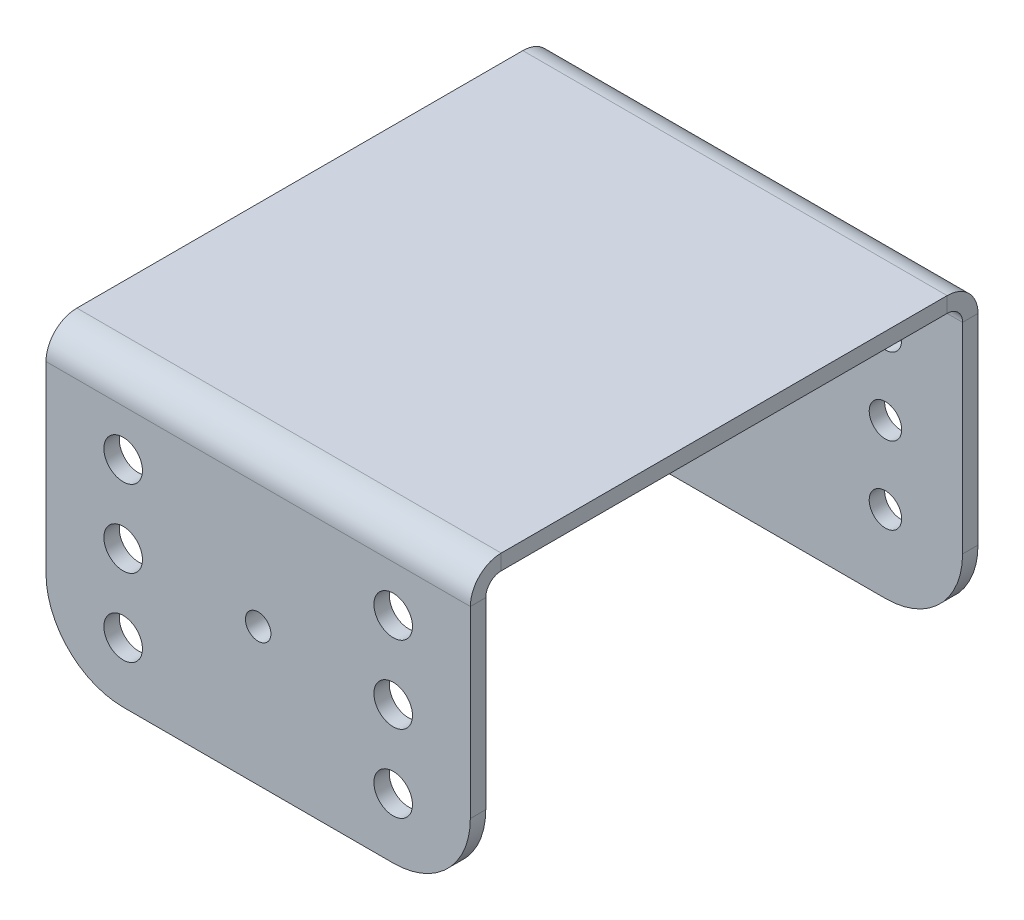
ISO-10303-21;
HEADER;
FILE_DESCRIPTION(('STEP AP214'),'2;1');
FILE_NAME('part.step','',(''),(''),'','','');
FILE_SCHEMA(('AUTOMOTIVE_DESIGN { 1 0 10303 214 1 1 1 1 }'));
ENDSEC;
DATA;
#1=APPLICATION_CONTEXT('core data for automotive mechanical design processes');
#2=APPLICATION_PROTOCOL_DEFINITION('international standard','automotive_design',2000,#1);
#3=PRODUCT_CONTEXT('',#1,'mechanical');
#4=PRODUCT('Part','Part','',(#3));
#5=PRODUCT_RELATED_PRODUCT_CATEGORY('part','',(#4));
#6=PRODUCT_DEFINITION_FORMATION('','',#4);
#7=PRODUCT_DEFINITION_CONTEXT('part definition',#1,'design');
#8=PRODUCT_DEFINITION('design','',#6,#7);
#9=PRODUCT_DEFINITION_SHAPE('','',#8);
#10=(LENGTH_UNIT() NAMED_UNIT(*) SI_UNIT(.MILLI.,.METRE.));
#11=(NAMED_UNIT(*) PLANE_ANGLE_UNIT() SI_UNIT($,.RADIAN.));
#12=(NAMED_UNIT(*) SI_UNIT($,.STERADIAN.) SOLID_ANGLE_UNIT());
#13=UNCERTAINTY_MEASURE_WITH_UNIT(LENGTH_MEASURE(1.E-05),#10,'distance_accuracy_value','');
#14=(GEOMETRIC_REPRESENTATION_CONTEXT(3) GLOBAL_UNCERTAINTY_ASSIGNED_CONTEXT((#13)) GLOBAL_UNIT_ASSIGNED_CONTEXT((#10,
#11,#12)) REPRESENTATION_CONTEXT('',''));
#15=CARTESIAN_POINT('',(0.,0.,0.));
#16=DIRECTION('',(0.,0.,1.));
#17=DIRECTION('',(1.,0.,0.));
#18=AXIS2_PLACEMENT_3D('',#15,#16,#17);
#19=CARTESIAN_POINT('',(27.5,20.,0.));
#20=DIRECTION('',(-1.,0.,0.));
#21=DIRECTION('',(0.,0.,1.));
#22=AXIS2_PLACEMENT_3D('',#19,#20,#21);
#23=PLANE('',#22);
#24=DIRECTION('',(0.,1.,0.));
#25=VECTOR('',#24,1.);
#26=CARTESIAN_POINT('',(27.5,18.0000000000002,59.8));
#27=LINE('',#26,#25);
#28=CARTESIAN_POINT('',(27.5,18.0000000000002,59.8));
#29=VERTEX_POINT('',#28);
#30=CARTESIAN_POINT('',(27.5,20.0000000000002,59.8));
#31=VERTEX_POINT('',#30);
#32=EDGE_CURVE('E316',#29,#31,#27,.T.);
#33=ORIENTED_EDGE('',*,*,#32,.F.);
#34=DIRECTION('',(0.,0.,1.));
#35=VECTOR('',#34,1.);
#36=CARTESIAN_POINT('',(27.5,18.,0.));
#37=LINE('',#36,#35);
#38=CARTESIAN_POINT('',(27.5,18.,1.99999999999999));
#39=VERTEX_POINT('',#38);
#40=EDGE_CURVE('E329',#29,#39,#37,.F.);
#41=ORIENTED_EDGE('',*,*,#40,.T.);
#42=DIRECTION('',(0.,-1.,0.));
#43=VECTOR('',#42,1.);
#44=CARTESIAN_POINT('',(27.5,20.,1.99999999999998));
#45=LINE('',#44,#43);
#46=CARTESIAN_POINT('',(27.5,20.,1.99999999999998));
#47=VERTEX_POINT('',#46);
#48=EDGE_CURVE('E319',#39,#47,#45,.F.);
#49=ORIENTED_EDGE('',*,*,#48,.T.);
#50=DIRECTION('',(0.,0.,-1.));
#51=VECTOR('',#50,1.);
#52=CARTESIAN_POINT('',(27.5,20.,0.));
#53=LINE('',#52,#51);
#54=EDGE_CURVE('E325',#31,#47,#53,.T.);
#55=ORIENTED_EDGE('',*,*,#54,.F.);
#56=EDGE_LOOP('',(#33,#41,#49,#55));
#57=FACE_BOUND('',#56,.T.);
#58=ADVANCED_FACE('F98',(#57),#23,.F.);
#59=CARTESIAN_POINT('',(-27.5,20.0000000000002,63.8));
#60=DIRECTION('',(1.,0.,0.));
#61=DIRECTION('',(0.,0.,-1.));
#62=AXIS2_PLACEMENT_3D('',#59,#60,#61);
#63=PLANE('',#62);
#64=DIRECTION('',(0.,1.,0.));
#65=VECTOR('',#64,1.);
#66=CARTESIAN_POINT('',(-27.5,18.0000000000002,59.8));
#67=LINE('',#66,#65);
#68=CARTESIAN_POINT('',(-27.5,18.0000000000002,59.8));
#69=VERTEX_POINT('',#68);
#70=CARTESIAN_POINT('',(-27.5,20.0000000000002,59.8));
#71=VERTEX_POINT('',#70);
#72=EDGE_CURVE('E310',#69,#71,#67,.T.);
#73=ORIENTED_EDGE('',*,*,#72,.T.);
#74=DIRECTION('',(0.,0.,1.));
#75=VECTOR('',#74,1.);
#76=CARTESIAN_POINT('',(-27.5,20.,0.));
#77=LINE('',#76,#75);
#78=CARTESIAN_POINT('',(-27.5,20.,1.99999999999998));
#79=VERTEX_POINT('',#78);
#80=EDGE_CURVE('E322',#79,#71,#77,.T.);
#81=ORIENTED_EDGE('',*,*,#80,.F.);
#82=DIRECTION('',(0.,-1.,0.));
#83=VECTOR('',#82,1.);
#84=CARTESIAN_POINT('',(-27.5,18.,1.99999999999999));
#85=LINE('',#84,#83);
#86=CARTESIAN_POINT('',(-27.5,18.,1.99999999999999));
#87=VERTEX_POINT('',#86);
#88=EDGE_CURVE('E334',#87,#79,#85,.F.);
#89=ORIENTED_EDGE('',*,*,#88,.F.);
#90=DIRECTION('',(0.,0.,-1.));
#91=VECTOR('',#90,1.);
#92=CARTESIAN_POINT('',(-27.5,18.0000000000002,63.8));
#93=LINE('',#92,#91);
#94=EDGE_CURVE('E327',#87,#69,#93,.F.);
#95=ORIENTED_EDGE('',*,*,#94,.T.);
#96=EDGE_LOOP('',(#73,#81,#89,#95));
#97=FACE_BOUND('',#96,.T.);
#98=ADVANCED_FACE('F556',(#97),#63,.F.);
#99=CARTESIAN_POINT('',(0.,20.,0.));
#100=DIRECTION('',(0.,-1.,0.));
#101=DIRECTION('',(0.,0.,-1.));
#102=AXIS2_PLACEMENT_3D('',#99,#100,#101);
#103=PLANE('',#102);
#104=DIRECTION('',(-1.,0.,0.));
#105=VECTOR('',#104,1.);
#106=CARTESIAN_POINT('',(-27.5,20.0000000000002,59.8));
#107=LINE('',#106,#105);
#108=EDGE_CURVE('E222',#71,#31,#107,.F.);
#109=ORIENTED_EDGE('',*,*,#108,.T.);
#110=ORIENTED_EDGE('',*,*,#54,.T.);
#111=DIRECTION('',(-1.,0.,0.));
#112=VECTOR('',#111,1.);
#113=CARTESIAN_POINT('',(27.5,20.,1.99999999999998));
#114=LINE('',#113,#112);
#115=EDGE_CURVE('E331',#79,#47,#114,.F.);
#116=ORIENTED_EDGE('',*,*,#115,.F.);
#117=ORIENTED_EDGE('',*,*,#80,.T.);
#118=EDGE_LOOP('',(#109,#110,#116,#117));
#119=FACE_BOUND('',#118,.T.);
#120=ADVANCED_FACE('F561',(#119),#103,.F.);
#121=CARTESIAN_POINT('',(0.,18.,0.));
#122=DIRECTION('',(0.,-1.,0.));
#123=DIRECTION('',(0.,0.,-1.));
#124=AXIS2_PLACEMENT_3D('',#121,#122,#123);
#125=PLANE('',#124);
#126=ORIENTED_EDGE('',*,*,#40,.F.);
#127=DIRECTION('',(-1.,0.,0.));
#128=VECTOR('',#127,1.);
#129=CARTESIAN_POINT('',(-27.5,18.0000000000002,59.8));
#130=LINE('',#129,#128);
#131=EDGE_CURVE('E114',#69,#29,#130,.F.);
#132=ORIENTED_EDGE('',*,*,#131,.F.);
#133=ORIENTED_EDGE('',*,*,#94,.F.);
#134=DIRECTION('',(-1.,0.,0.));
#135=VECTOR('',#134,1.);
#136=CARTESIAN_POINT('',(27.5,18.,1.99999999999999));
#137=LINE('',#136,#135);
#138=EDGE_CURVE('E337',#39,#87,#137,.T.);
#139=ORIENTED_EDGE('',*,*,#138,.F.);
#140=EDGE_LOOP('',(#126,#132,#133,#139));
#141=FACE_BOUND('',#140,.T.);
#142=ADVANCED_FACE('F462',(#141),#125,.T.);
#143=CARTESIAN_POINT('',(-27.5,20.,-2.));
#144=DIRECTION('',(-1.,0.,0.));
#145=DIRECTION('',(0.,-1.,0.));
#146=AXIS2_PLACEMENT_3D('',#143,#144,#145);
#147=PLANE('',#146);
#148=DIRECTION('',(0.,-1.,0.));
#149=VECTOR('',#148,1.);
#150=CARTESIAN_POINT('',(-27.5,20.,0.));
#151=LINE('',#150,#149);
#152=CARTESIAN_POINT('',(-27.5,16.,0.));
#153=VERTEX_POINT('',#152);
#154=CARTESIAN_POINT('',(-27.5,-9.99999999999993,0.));
#155=VERTEX_POINT('',#154);
#156=EDGE_CURVE('E395',#153,#155,#151,.T.);
#157=ORIENTED_EDGE('',*,*,#156,.F.);
#158=DIRECTION('',(0.,0.,-1.));
#159=VECTOR('',#158,1.);
#160=CARTESIAN_POINT('',(-27.5,16.,0.));
#161=LINE('',#160,#159);
#162=CARTESIAN_POINT('',(-27.5,16.,-2.));
#163=VERTEX_POINT('',#162);
#164=EDGE_CURVE('E347',#153,#163,#161,.T.);
#165=ORIENTED_EDGE('',*,*,#164,.T.);
#166=DIRECTION('',(0.,-1.,0.));
#167=VECTOR('',#166,1.);
#168=CARTESIAN_POINT('',(-27.5,20.,-2.));
#169=LINE('',#168,#167);
#170=CARTESIAN_POINT('',(-27.5,-9.99999999999993,-2.));
#171=VERTEX_POINT('',#170);
#172=EDGE_CURVE('E398',#163,#171,#169,.T.);
#173=ORIENTED_EDGE('',*,*,#172,.T.);
#174=DIRECTION('',(0.,0.,1.));
#175=VECTOR('',#174,1.);
#176=CARTESIAN_POINT('',(-27.5,-9.99999999999993,-2.));
#177=LINE('',#176,#175);
#178=EDGE_CURVE('E413',#171,#155,#177,.T.);
#179=ORIENTED_EDGE('',*,*,#178,.T.);
#180=EDGE_LOOP('',(#157,#165,#173,#179));
#181=FACE_BOUND('',#180,.T.);
#182=ADVANCED_FACE('F100',(#181),#147,.T.);
#183=CARTESIAN_POINT('',(-17.5,-10.,-2.));
#184=DIRECTION('',(0.,0.,1.));
#185=DIRECTION('',(1.,0.,0.));
#186=AXIS2_PLACEMENT_3D('',#183,#184,#185);
#187=PLANE('',#186);
#188=CARTESIAN_POINT('',(-17.5,10.,-2.));
#189=DIRECTION('',(0.,0.,1.));
#190=DIRECTION('',(1.,0.,0.));
#191=AXIS2_PLACEMENT_3D('',#188,#189,#190);
#192=CIRCLE('',#191,2.1);
#193=CARTESIAN_POINT('',(-15.4,10.,-2.));
#194=VERTEX_POINT('',#193);
#195=EDGE_CURVE('E392',#194,#194,#192,.T.);
#196=ORIENTED_EDGE('',*,*,#195,.T.);
#197=EDGE_LOOP('',(#196));
#198=FACE_BOUND('',#197,.T.);
#199=CARTESIAN_POINT('',(17.5,10.,-2.));
#200=DIRECTION('',(0.,0.,1.));
#201=DIRECTION('',(-1.,0.,0.));
#202=AXIS2_PLACEMENT_3D('',#199,#200,#201);
#203=CIRCLE('',#202,2.1);
#204=CARTESIAN_POINT('',(15.4,10.,-2.));
#205=VERTEX_POINT('',#204);
#206=EDGE_CURVE('E386',#205,#205,#203,.T.);
#207=ORIENTED_EDGE('',*,*,#206,.T.);
#208=EDGE_LOOP('',(#207));
#209=FACE_BOUND('',#208,.T.);
#210=CARTESIAN_POINT('',(17.5,-10.,-2.));
#211=DIRECTION('',(0.,0.,1.));
#212=DIRECTION('',(1.,0.,0.));
#213=AXIS2_PLACEMENT_3D('',#210,#211,#212);
#214=CIRCLE('',#213,2.1);
#215=CARTESIAN_POINT('',(19.6,-10.,-2.));
#216=VERTEX_POINT('',#215);
#217=EDGE_CURVE('E380',#216,#216,#214,.T.);
#218=ORIENTED_EDGE('',*,*,#217,.T.);
#219=EDGE_LOOP('',(#218));
#220=FACE_BOUND('',#219,.T.);
#221=CARTESIAN_POINT('',(-17.5,-10.,-2.));
#222=DIRECTION('',(0.,0.,1.));
#223=DIRECTION('',(-1.,0.,0.));
#224=AXIS2_PLACEMENT_3D('',#221,#222,#223);
#225=CIRCLE('',#224,2.1);
#226=CARTESIAN_POINT('',(-19.6,-10.,-2.));
#227=VERTEX_POINT('',#226);
#228=EDGE_CURVE('E374',#227,#227,#225,.T.);
#229=ORIENTED_EDGE('',*,*,#228,.T.);
#230=EDGE_LOOP('',(#229));
#231=FACE_BOUND('',#230,.T.);
#232=CARTESIAN_POINT('',(-17.5,0.,-2.));
#233=DIRECTION('',(0.,0.,1.));
#234=DIRECTION('',(1.,0.,0.));
#235=AXIS2_PLACEMENT_3D('',#232,#233,#234);
#236=CIRCLE('',#235,2.1);
#237=CARTESIAN_POINT('',(-15.4,0.,-2.));
#238=VERTEX_POINT('',#237);
#239=EDGE_CURVE('E368',#238,#238,#236,.T.);
#240=ORIENTED_EDGE('',*,*,#239,.T.);
#241=EDGE_LOOP('',(#240));
#242=FACE_BOUND('',#241,.T.);
#243=CARTESIAN_POINT('',(17.5,0.,-2.));
#244=DIRECTION('',(0.,0.,1.));
#245=DIRECTION('',(1.,0.,0.));
#246=AXIS2_PLACEMENT_3D('',#243,#244,#245);
#247=CIRCLE('',#246,2.1);
#248=CARTESIAN_POINT('',(19.6,0.,-2.));
#249=VERTEX_POINT('',#248);
#250=EDGE_CURVE('E362',#249,#249,#247,.T.);
#251=ORIENTED_EDGE('',*,*,#250,.T.);
#252=EDGE_LOOP('',(#251));
#253=FACE_BOUND('',#252,.T.);
#254=DIRECTION('',(-1.,0.,0.));
#255=VECTOR('',#254,1.);
#256=CARTESIAN_POINT('',(-27.5,16.,-2.));
#257=LINE('',#256,#255);
#258=CARTESIAN_POINT('',(27.5,16.,-2.));
#259=VERTEX_POINT('',#258);
#260=EDGE_CURVE('E341',#163,#259,#257,.F.);
#261=ORIENTED_EDGE('',*,*,#260,.T.);
#262=DIRECTION('',(0.,1.,0.));
#263=VECTOR('',#262,1.);
#264=CARTESIAN_POINT('',(27.5,20.,-2.));
#265=LINE('',#264,#263);
#266=CARTESIAN_POINT('',(27.5,-9.99999999999993,-2.));
#267=VERTEX_POINT('',#266);
#268=EDGE_CURVE('E410',#267,#259,#265,.T.);
#269=ORIENTED_EDGE('',*,*,#268,.F.);
#270=CARTESIAN_POINT('',(17.5,-10.,-2.));
#271=DIRECTION('',(0.,0.,1.));
#272=DIRECTION('',(1.,0.,0.));
#273=AXIS2_PLACEMENT_3D('',#270,#271,#272);
#274=CIRCLE('',#273,10.);
#275=CARTESIAN_POINT('',(17.4999999999999,-20.,-2.));
#276=VERTEX_POINT('',#275);
#277=EDGE_CURVE('E407',#276,#267,#274,.T.);
#278=ORIENTED_EDGE('',*,*,#277,.F.);
#279=DIRECTION('',(1.,0.,0.));
#280=VECTOR('',#279,1.);
#281=CARTESIAN_POINT('',(-17.4999999999999,-20.,-2.));
#282=LINE('',#281,#280);
#283=CARTESIAN_POINT('',(-17.4999999999999,-20.,-2.));
#284=VERTEX_POINT('',#283);
#285=EDGE_CURVE('E404',#284,#276,#282,.T.);
#286=ORIENTED_EDGE('',*,*,#285,.F.);
#287=CARTESIAN_POINT('',(-17.5,-10.,-2.));
#288=DIRECTION('',(0.,0.,1.));
#289=DIRECTION('',(1.,0.,0.));
#290=AXIS2_PLACEMENT_3D('',#287,#288,#289);
#291=CIRCLE('',#290,10.);
#292=EDGE_CURVE('E400',#171,#284,#291,.T.);
#293=ORIENTED_EDGE('',*,*,#292,.F.);
#294=ORIENTED_EDGE('',*,*,#172,.F.);
#295=EDGE_LOOP('',(#261,#269,#278,#286,#293,#294));
#296=FACE_BOUND('',#295,.T.);
#297=ADVANCED_FACE('F602',(#198,#209,#220,#231,#242,#253,#296),#187,.F.);
#298=CARTESIAN_POINT('',(-17.5,-10.,0.));
#299=DIRECTION('',(0.,0.,1.));
#300=DIRECTION('',(1.,0.,0.));
#301=AXIS2_PLACEMENT_3D('',#298,#299,#300);
#302=PLANE('',#301);
#303=CARTESIAN_POINT('',(17.5,0.,0.));
#304=DIRECTION('',(0.,0.,1.));
#305=DIRECTION('',(1.,0.,0.));
#306=AXIS2_PLACEMENT_3D('',#303,#304,#305);
#307=CIRCLE('',#306,2.1);
#308=CARTESIAN_POINT('',(19.6,0.,0.));
#309=VERTEX_POINT('',#308);
#310=EDGE_CURVE('E359',#309,#309,#307,.T.);
#311=ORIENTED_EDGE('',*,*,#310,.F.);
#312=EDGE_LOOP('',(#311));
#313=FACE_BOUND('',#312,.T.);
#314=CARTESIAN_POINT('',(-17.5,0.,0.));
#315=DIRECTION('',(0.,0.,1.));
#316=DIRECTION('',(1.,0.,0.));
#317=AXIS2_PLACEMENT_3D('',#314,#315,#316);
#318=CIRCLE('',#317,2.1);
#319=CARTESIAN_POINT('',(-15.4,0.,0.));
#320=VERTEX_POINT('',#319);
#321=EDGE_CURVE('E365',#320,#320,#318,.T.);
#322=ORIENTED_EDGE('',*,*,#321,.F.);
#323=EDGE_LOOP('',(#322));
#324=FACE_BOUND('',#323,.T.);
#325=CARTESIAN_POINT('',(-17.5,-10.,0.));
#326=DIRECTION('',(0.,0.,1.));
#327=DIRECTION('',(-1.,0.,0.));
#328=AXIS2_PLACEMENT_3D('',#325,#326,#327);
#329=CIRCLE('',#328,2.1);
#330=CARTESIAN_POINT('',(-19.6,-10.,0.));
#331=VERTEX_POINT('',#330);
#332=EDGE_CURVE('E371',#331,#331,#329,.T.);
#333=ORIENTED_EDGE('',*,*,#332,.F.);
#334=EDGE_LOOP('',(#333));
#335=FACE_BOUND('',#334,.T.);
#336=CARTESIAN_POINT('',(17.5,-10.,0.));
#337=DIRECTION('',(0.,0.,1.));
#338=DIRECTION('',(1.,0.,0.));
#339=AXIS2_PLACEMENT_3D('',#336,#337,#338);
#340=CIRCLE('',#339,2.1);
#341=CARTESIAN_POINT('',(19.6,-10.,0.));
#342=VERTEX_POINT('',#341);
#343=EDGE_CURVE('E377',#342,#342,#340,.T.);
#344=ORIENTED_EDGE('',*,*,#343,.F.);
#345=EDGE_LOOP('',(#344));
#346=FACE_BOUND('',#345,.T.);
#347=CARTESIAN_POINT('',(17.5,10.,0.));
#348=DIRECTION('',(0.,0.,1.));
#349=DIRECTION('',(-1.,0.,0.));
#350=AXIS2_PLACEMENT_3D('',#347,#348,#349);
#351=CIRCLE('',#350,2.1);
#352=CARTESIAN_POINT('',(15.4,10.,0.));
#353=VERTEX_POINT('',#352);
#354=EDGE_CURVE('E383',#353,#353,#351,.T.);
#355=ORIENTED_EDGE('',*,*,#354,.F.);
#356=EDGE_LOOP('',(#355));
#357=FACE_BOUND('',#356,.T.);
#358=CARTESIAN_POINT('',(-17.5,10.,0.));
#359=DIRECTION('',(0.,0.,1.));
#360=DIRECTION('',(1.,0.,0.));
#361=AXIS2_PLACEMENT_3D('',#358,#359,#360);
#362=CIRCLE('',#361,2.1);
#363=CARTESIAN_POINT('',(-15.4,10.,0.));
#364=VERTEX_POINT('',#363);
#365=EDGE_CURVE('E389',#364,#364,#362,.T.);
#366=ORIENTED_EDGE('',*,*,#365,.F.);
#367=EDGE_LOOP('',(#366));
#368=FACE_BOUND('',#367,.T.);
#369=DIRECTION('',(0.,1.,0.));
#370=VECTOR('',#369,1.);
#371=CARTESIAN_POINT('',(27.5,20.,0.));
#372=LINE('',#371,#370);
#373=CARTESIAN_POINT('',(27.5,-9.99999999999993,0.));
#374=VERTEX_POINT('',#373);
#375=CARTESIAN_POINT('',(27.5,16.,0.));
#376=VERTEX_POINT('',#375);
#377=EDGE_CURVE('E401',#374,#376,#372,.T.);
#378=ORIENTED_EDGE('',*,*,#377,.T.);
#379=DIRECTION('',(-1.,0.,0.));
#380=VECTOR('',#379,1.);
#381=CARTESIAN_POINT('',(-27.5,16.,0.));
#382=LINE('',#381,#380);
#383=EDGE_CURVE('E122',#153,#376,#382,.F.);
#384=ORIENTED_EDGE('',*,*,#383,.F.);
#385=ORIENTED_EDGE('',*,*,#156,.T.);
#386=CARTESIAN_POINT('',(-17.5,-10.,0.));
#387=DIRECTION('',(0.,0.,1.));
#388=DIRECTION('',(1.,0.,0.));
#389=AXIS2_PLACEMENT_3D('',#386,#387,#388);
#390=CIRCLE('',#389,10.);
#391=CARTESIAN_POINT('',(-17.4999999999999,-20.,0.));
#392=VERTEX_POINT('',#391);
#393=EDGE_CURVE('E415',#155,#392,#390,.T.);
#394=ORIENTED_EDGE('',*,*,#393,.T.);
#395=DIRECTION('',(1.,0.,0.));
#396=VECTOR('',#395,1.);
#397=CARTESIAN_POINT('',(-17.4999999999999,-20.,0.));
#398=LINE('',#397,#396);
#399=CARTESIAN_POINT('',(17.4999999999999,-20.,0.));
#400=VERTEX_POINT('',#399);
#401=EDGE_CURVE('E418',#392,#400,#398,.T.);
#402=ORIENTED_EDGE('',*,*,#401,.T.);
#403=CARTESIAN_POINT('',(17.5,-10.,0.));
#404=DIRECTION('',(0.,0.,1.));
#405=DIRECTION('',(1.,0.,0.));
#406=AXIS2_PLACEMENT_3D('',#403,#404,#405);
#407=CIRCLE('',#406,10.);
#408=EDGE_CURVE('E421',#400,#374,#407,.T.);
#409=ORIENTED_EDGE('',*,*,#408,.T.);
#410=EDGE_LOOP('',(#378,#384,#385,#394,#402,#409));
#411=FACE_BOUND('',#410,.T.);
#412=ADVANCED_FACE('F439',(#313,#324,#335,#346,#357,#368,#411),#302,.T.);
#413=CARTESIAN_POINT('',(27.5,20.,-2.));
#414=DIRECTION('',(1.,0.,0.));
#415=DIRECTION('',(0.,1.,0.));
#416=AXIS2_PLACEMENT_3D('',#413,#414,#415);
#417=PLANE('',#416);
#418=DIRECTION('',(0.,0.,-1.));
#419=VECTOR('',#418,1.);
#420=CARTESIAN_POINT('',(27.5,16.,0.));
#421=LINE('',#420,#419);
#422=EDGE_CURVE('E356',#376,#259,#421,.T.);
#423=ORIENTED_EDGE('',*,*,#422,.F.);
#424=ORIENTED_EDGE('',*,*,#377,.F.);
#425=DIRECTION('',(0.,0.,1.));
#426=VECTOR('',#425,1.);
#427=CARTESIAN_POINT('',(27.5,-9.99999999999993,-2.));
#428=LINE('',#427,#426);
#429=EDGE_CURVE('E107',#267,#374,#428,.T.);
#430=ORIENTED_EDGE('',*,*,#429,.F.);
#431=ORIENTED_EDGE('',*,*,#268,.T.);
#432=EDGE_LOOP('',(#423,#424,#430,#431));
#433=FACE_BOUND('',#432,.T.);
#434=ADVANCED_FACE('F450',(#433),#417,.T.);
#435=CARTESIAN_POINT('',(17.5,-10.,-2.));
#436=DIRECTION('',(0.,0.,1.));
#437=DIRECTION('',(1.,0.,0.));
#438=AXIS2_PLACEMENT_3D('',#435,#436,#437);
#439=CYLINDRICAL_SURFACE('',#438,10.);
#440=ORIENTED_EDGE('',*,*,#408,.F.);
#441=DIRECTION('',(0.,0.,1.));
#442=VECTOR('',#441,1.);
#443=CARTESIAN_POINT('',(17.4999999999999,-20.,-2.));
#444=LINE('',#443,#442);
#445=EDGE_CURVE('E426',#276,#400,#444,.T.);
#446=ORIENTED_EDGE('',*,*,#445,.F.);
#447=ORIENTED_EDGE('',*,*,#277,.T.);
#448=ORIENTED_EDGE('',*,*,#429,.T.);
#449=EDGE_LOOP('',(#440,#446,#447,#448));
#450=FACE_BOUND('',#449,.T.);
#451=ADVANCED_FACE('F446',(#450),#439,.T.);
#452=CARTESIAN_POINT('',(-17.4999999999999,-20.,-2.));
#453=DIRECTION('',(0.,-1.,0.));
#454=DIRECTION('',(0.,0.,-1.));
#455=AXIS2_PLACEMENT_3D('',#452,#453,#454);
#456=PLANE('',#455);
#457=ORIENTED_EDGE('',*,*,#401,.F.);
#458=DIRECTION('',(0.,0.,1.));
#459=VECTOR('',#458,1.);
#460=CARTESIAN_POINT('',(-17.4999999999999,-20.,-2.));
#461=LINE('',#460,#459);
#462=EDGE_CURVE('E428',#284,#392,#461,.T.);
#463=ORIENTED_EDGE('',*,*,#462,.F.);
#464=ORIENTED_EDGE('',*,*,#285,.T.);
#465=ORIENTED_EDGE('',*,*,#445,.T.);
#466=EDGE_LOOP('',(#457,#463,#464,#465));
#467=FACE_BOUND('',#466,.T.);
#468=ADVANCED_FACE('F442',(#467),#456,.T.);
#469=CARTESIAN_POINT('',(-17.5,-10.,-2.));
#470=DIRECTION('',(0.,0.,1.));
#471=DIRECTION('',(1.,0.,0.));
#472=AXIS2_PLACEMENT_3D('',#469,#470,#471);
#473=CYLINDRICAL_SURFACE('',#472,10.);
#474=ORIENTED_EDGE('',*,*,#393,.F.);
#475=ORIENTED_EDGE('',*,*,#178,.F.);
#476=ORIENTED_EDGE('',*,*,#292,.T.);
#477=ORIENTED_EDGE('',*,*,#462,.T.);
#478=EDGE_LOOP('',(#474,#475,#476,#477));
#479=FACE_BOUND('',#478,.T.);
#480=ADVANCED_FACE('F437',(#479),#473,.T.);
#481=CARTESIAN_POINT('',(-17.5,10.,-2.));
#482=DIRECTION('',(0.,0.,1.));
#483=DIRECTION('',(1.,0.,0.));
#484=AXIS2_PLACEMENT_3D('',#481,#482,#483);
#485=CYLINDRICAL_SURFACE('',#484,2.1);
#486=ORIENTED_EDGE('',*,*,#195,.F.);
#487=EDGE_LOOP('',(#486));
#488=FACE_BOUND('',#487,.T.);
#489=ORIENTED_EDGE('',*,*,#365,.T.);
#490=EDGE_LOOP('',(#489));
#491=FACE_BOUND('',#490,.T.);
#492=ADVANCED_FACE('F597',(#488,#491),#485,.F.);
#493=CARTESIAN_POINT('',(17.5,10.,-2.));
#494=DIRECTION('',(0.,0.,1.));
#495=DIRECTION('',(1.,0.,0.));
#496=AXIS2_PLACEMENT_3D('',#493,#494,#495);
#497=CYLINDRICAL_SURFACE('',#496,2.1);
#498=ORIENTED_EDGE('',*,*,#206,.F.);
#499=EDGE_LOOP('',(#498));
#500=FACE_BOUND('',#499,.T.);
#501=ORIENTED_EDGE('',*,*,#354,.T.);
#502=EDGE_LOOP('',(#501));
#503=FACE_BOUND('',#502,.T.);
#504=ADVANCED_FACE('F593',(#500,#503),#497,.F.);
#505=CARTESIAN_POINT('',(17.5,-10.,-2.));
#506=DIRECTION('',(0.,0.,1.));
#507=DIRECTION('',(1.,0.,0.));
#508=AXIS2_PLACEMENT_3D('',#505,#506,#507);
#509=CYLINDRICAL_SURFACE('',#508,2.1);
#510=ORIENTED_EDGE('',*,*,#217,.F.);
#511=EDGE_LOOP('',(#510));
#512=FACE_BOUND('',#511,.T.);
#513=ORIENTED_EDGE('',*,*,#343,.T.);
#514=EDGE_LOOP('',(#513));
#515=FACE_BOUND('',#514,.T.);
#516=ADVANCED_FACE('F589',(#512,#515),#509,.F.);
#517=CARTESIAN_POINT('',(-17.5,-10.,-2.));
#518=DIRECTION('',(0.,0.,1.));
#519=DIRECTION('',(1.,0.,0.));
#520=AXIS2_PLACEMENT_3D('',#517,#518,#519);
#521=CYLINDRICAL_SURFACE('',#520,2.1);
#522=ORIENTED_EDGE('',*,*,#228,.F.);
#523=EDGE_LOOP('',(#522));
#524=FACE_BOUND('',#523,.T.);
#525=ORIENTED_EDGE('',*,*,#332,.T.);
#526=EDGE_LOOP('',(#525));
#527=FACE_BOUND('',#526,.T.);
#528=ADVANCED_FACE('F585',(#524,#527),#521,.F.);
#529=CARTESIAN_POINT('',(-17.5,0.,-2.));
#530=DIRECTION('',(0.,0.,1.));
#531=DIRECTION('',(1.,0.,0.));
#532=AXIS2_PLACEMENT_3D('',#529,#530,#531);
#533=CYLINDRICAL_SURFACE('',#532,2.1);
#534=ORIENTED_EDGE('',*,*,#239,.F.);
#535=EDGE_LOOP('',(#534));
#536=FACE_BOUND('',#535,.T.);
#537=ORIENTED_EDGE('',*,*,#321,.T.);
#538=EDGE_LOOP('',(#537));
#539=FACE_BOUND('',#538,.T.);
#540=ADVANCED_FACE('F581',(#536,#539),#533,.F.);
#541=CARTESIAN_POINT('',(17.5,0.,-2.));
#542=DIRECTION('',(0.,0.,1.));
#543=DIRECTION('',(1.,0.,0.));
#544=AXIS2_PLACEMENT_3D('',#541,#542,#543);
#545=CYLINDRICAL_SURFACE('',#544,2.1);
#546=ORIENTED_EDGE('',*,*,#250,.F.);
#547=EDGE_LOOP('',(#546));
#548=FACE_BOUND('',#547,.T.);
#549=ORIENTED_EDGE('',*,*,#310,.T.);
#550=EDGE_LOOP('',(#549));
#551=FACE_BOUND('',#550,.T.);
#552=ADVANCED_FACE('F575',(#548,#551),#545,.F.);
#553=CARTESIAN_POINT('',(27.5,16.,2.));
#554=DIRECTION('',(1.,0.,0.));
#555=DIRECTION('',(0.,0.,-1.));
#556=AXIS2_PLACEMENT_3D('',#553,#554,#555);
#557=PLANE('',#556);
#558=ORIENTED_EDGE('',*,*,#48,.F.);
#559=CARTESIAN_POINT('',(27.5,16.,2.));
#560=DIRECTION('',(-1.,0.,0.));
#561=DIRECTION('',(0.,0.,1.));
#562=AXIS2_PLACEMENT_3D('',#559,#560,#561);
#563=CIRCLE('',#562,2.);
#564=EDGE_CURVE('E350',#376,#39,#563,.F.);
#565=ORIENTED_EDGE('',*,*,#564,.F.);
#566=ORIENTED_EDGE('',*,*,#422,.T.);
#567=CARTESIAN_POINT('',(27.5,16.,2.));
#568=DIRECTION('',(-1.,0.,0.));
#569=DIRECTION('',(0.,0.,1.));
#570=AXIS2_PLACEMENT_3D('',#567,#568,#569);
#571=CIRCLE('',#570,4.);
#572=EDGE_CURVE('E343',#259,#47,#571,.F.);
#573=ORIENTED_EDGE('',*,*,#572,.T.);
#574=EDGE_LOOP('',(#558,#565,#566,#573));
#575=FACE_BOUND('',#574,.T.);
#576=ADVANCED_FACE('F458',(#575),#557,.T.);
#577=CARTESIAN_POINT('',(-27.5,16.,2.));
#578=DIRECTION('',(1.,0.,0.));
#579=DIRECTION('',(0.,0.,-1.));
#580=AXIS2_PLACEMENT_3D('',#577,#578,#579);
#581=PLANE('',#580);
#582=CARTESIAN_POINT('',(-27.5,16.,2.));
#583=DIRECTION('',(-1.,0.,0.));
#584=DIRECTION('',(0.,0.,1.));
#585=AXIS2_PLACEMENT_3D('',#582,#583,#584);
#586=CIRCLE('',#585,2.);
#587=EDGE_CURVE('E324',#87,#153,#586,.T.);
#588=ORIENTED_EDGE('',*,*,#587,.F.);
#589=ORIENTED_EDGE('',*,*,#88,.T.);
#590=CARTESIAN_POINT('',(-27.5,16.,2.));
#591=DIRECTION('',(-1.,0.,0.));
#592=DIRECTION('',(0.,0.,1.));
#593=AXIS2_PLACEMENT_3D('',#590,#591,#592);
#594=CIRCLE('',#593,4.);
#595=EDGE_CURVE('E344',#79,#163,#594,.T.);
#596=ORIENTED_EDGE('',*,*,#595,.T.);
#597=ORIENTED_EDGE('',*,*,#164,.F.);
#598=EDGE_LOOP('',(#588,#589,#596,#597));
#599=FACE_BOUND('',#598,.T.);
#600=ADVANCED_FACE('F569',(#599),#581,.F.);
#601=CARTESIAN_POINT('',(-27.5,16.,2.));
#602=DIRECTION('',(-1.,0.,0.));
#603=DIRECTION('',(0.,1.,0.));
#604=AXIS2_PLACEMENT_3D('',#601,#602,#603);
#605=CYLINDRICAL_SURFACE('',#604,4.);
#606=ORIENTED_EDGE('',*,*,#260,.F.);
#607=ORIENTED_EDGE('',*,*,#595,.F.);
#608=ORIENTED_EDGE('',*,*,#115,.T.);
#609=ORIENTED_EDGE('',*,*,#572,.F.);
#610=EDGE_LOOP('',(#606,#607,#608,#609));
#611=FACE_BOUND('',#610,.T.);
#612=ADVANCED_FACE('F566',(#611),#605,.T.);
#613=CARTESIAN_POINT('',(-27.5,16.,2.));
#614=DIRECTION('',(-1.,0.,0.));
#615=DIRECTION('',(0.,1.,0.));
#616=AXIS2_PLACEMENT_3D('',#613,#614,#615);
#617=CYLINDRICAL_SURFACE('',#616,2.);
#618=ORIENTED_EDGE('',*,*,#383,.T.);
#619=ORIENTED_EDGE('',*,*,#564,.T.);
#620=ORIENTED_EDGE('',*,*,#138,.T.);
#621=ORIENTED_EDGE('',*,*,#587,.T.);
#622=EDGE_LOOP('',(#618,#619,#620,#621));
#623=FACE_BOUND('',#622,.T.);
#624=ADVANCED_FACE('F453',(#623),#617,.F.);
#625=CARTESIAN_POINT('',(27.5,16.0000000000002,59.8));
#626=DIRECTION('',(1.,0.,0.));
#627=DIRECTION('',(0.,0.,-1.));
#628=AXIS2_PLACEMENT_3D('',#625,#626,#627);
#629=PLANE('',#628);
#630=DIRECTION('',(0.,0.,-1.));
#631=VECTOR('',#630,1.);
#632=CARTESIAN_POINT('',(27.5,16.0000000000002,63.8));
#633=LINE('',#632,#631);
#634=CARTESIAN_POINT('',(27.5,16.0000000000002,61.8));
#635=VERTEX_POINT('',#634);
#636=CARTESIAN_POINT('',(27.5,16.0000000000003,63.8));
#637=VERTEX_POINT('',#636);
#638=EDGE_CURVE('E304',#635,#637,#633,.F.);
#639=ORIENTED_EDGE('',*,*,#638,.F.);
#640=CARTESIAN_POINT('',(27.5,16.0000000000002,59.8));
#641=DIRECTION('',(-1.,0.,0.));
#642=DIRECTION('',(0.,0.,1.));
#643=AXIS2_PLACEMENT_3D('',#640,#641,#642);
#644=CIRCLE('',#643,2.);
#645=EDGE_CURVE('E225',#29,#635,#644,.F.);
#646=ORIENTED_EDGE('',*,*,#645,.F.);
#647=ORIENTED_EDGE('',*,*,#32,.T.);
#648=CARTESIAN_POINT('',(27.5,16.0000000000002,59.8));
#649=DIRECTION('',(-1.,0.,0.));
#650=DIRECTION('',(0.,0.,1.));
#651=AXIS2_PLACEMENT_3D('',#648,#649,#650);
#652=CIRCLE('',#651,4.);
#653=EDGE_CURVE('E309',#31,#637,#652,.F.);
#654=ORIENTED_EDGE('',*,*,#653,.T.);
#655=EDGE_LOOP('',(#639,#646,#647,#654));
#656=FACE_BOUND('',#655,.T.);
#657=ADVANCED_FACE('F467',(#656),#629,.T.);
#658=CARTESIAN_POINT('',(-27.5,16.0000000000002,59.8));
#659=DIRECTION('',(1.,0.,0.));
#660=DIRECTION('',(0.,0.,-1.));
#661=AXIS2_PLACEMENT_3D('',#658,#659,#660);
#662=PLANE('',#661);
#663=CARTESIAN_POINT('',(-27.5,16.0000000000002,59.8));
#664=DIRECTION('',(-1.,0.,0.));
#665=DIRECTION('',(0.,0.,1.));
#666=AXIS2_PLACEMENT_3D('',#663,#664,#665);
#667=CIRCLE('',#666,2.);
#668=CARTESIAN_POINT('',(-27.5,16.0000000000002,61.8));
#669=VERTEX_POINT('',#668);
#670=EDGE_CURVE('E232',#669,#69,#667,.T.);
#671=ORIENTED_EDGE('',*,*,#670,.F.);
#672=DIRECTION('',(0.,0.,-1.));
#673=VECTOR('',#672,1.);
#674=CARTESIAN_POINT('',(-27.5,16.0000000000002,61.8));
#675=LINE('',#674,#673);
#676=CARTESIAN_POINT('',(-27.5,16.0000000000002,63.8));
#677=VERTEX_POINT('',#676);
#678=EDGE_CURVE('E229',#669,#677,#675,.F.);
#679=ORIENTED_EDGE('',*,*,#678,.T.);
#680=CARTESIAN_POINT('',(-27.5,16.0000000000002,59.8));
#681=DIRECTION('',(-1.,0.,0.));
#682=DIRECTION('',(0.,0.,1.));
#683=AXIS2_PLACEMENT_3D('',#680,#681,#682);
#684=CIRCLE('',#683,4.);
#685=EDGE_CURVE('E215',#677,#71,#684,.T.);
#686=ORIENTED_EDGE('',*,*,#685,.T.);
#687=ORIENTED_EDGE('',*,*,#72,.F.);
#688=EDGE_LOOP('',(#671,#679,#686,#687));
#689=FACE_BOUND('',#688,.T.);
#690=ADVANCED_FACE('F230',(#689),#662,.F.);
#691=CARTESIAN_POINT('',(-27.5,16.0000000000002,59.8));
#692=DIRECTION('',(-1.,0.,0.));
#693=DIRECTION('',(0.,0.,1.));
#694=AXIS2_PLACEMENT_3D('',#691,#692,#693);
#695=CYLINDRICAL_SURFACE('',#694,4.);
#696=ORIENTED_EDGE('',*,*,#108,.F.);
#697=ORIENTED_EDGE('',*,*,#685,.F.);
#698=DIRECTION('',(-1.,0.,0.));
#699=VECTOR('',#698,1.);
#700=CARTESIAN_POINT('',(17.5,16.0000000000002,63.8));
#701=LINE('',#700,#699);
#702=EDGE_CURVE('E220',#637,#677,#701,.T.);
#703=ORIENTED_EDGE('',*,*,#702,.F.);
#704=ORIENTED_EDGE('',*,*,#653,.F.);
#705=EDGE_LOOP('',(#696,#697,#703,#704));
#706=FACE_BOUND('',#705,.T.);
#707=ADVANCED_FACE('F217',(#706),#695,.T.);
#708=CARTESIAN_POINT('',(-27.5,16.0000000000002,59.8));
#709=DIRECTION('',(-1.,0.,0.));
#710=DIRECTION('',(0.,0.,1.));
#711=AXIS2_PLACEMENT_3D('',#708,#709,#710);
#712=CYLINDRICAL_SURFACE('',#711,2.);
#713=ORIENTED_EDGE('',*,*,#131,.T.);
#714=ORIENTED_EDGE('',*,*,#645,.T.);
#715=DIRECTION('',(1.,0.,0.));
#716=VECTOR('',#715,1.);
#717=CARTESIAN_POINT('',(27.5,16.0000000000002,61.8));
#718=LINE('',#717,#716);
#719=EDGE_CURVE('E236',#635,#669,#718,.F.);
#720=ORIENTED_EDGE('',*,*,#719,.T.);
#721=ORIENTED_EDGE('',*,*,#670,.T.);
#722=EDGE_LOOP('',(#713,#714,#720,#721));
#723=FACE_BOUND('',#722,.T.);
#724=ADVANCED_FACE('F465',(#723),#712,.F.);
#725=CARTESIAN_POINT('',(17.5,-7.79999999999977,63.8000000000002));
#726=DIRECTION('',(0.,0.,1.));
#727=DIRECTION('',(0.,-1.,0.));
#728=AXIS2_PLACEMENT_3D('',#725,#726,#727);
#729=PLANE('',#728);
#730=CARTESIAN_POINT('',(0.,0.,63.8000000000001));
#731=DIRECTION('',(0.,0.,1.));
#732=DIRECTION('',(1.,0.,0.));
#733=AXIS2_PLACEMENT_3D('',#730,#731,#732);
#734=CIRCLE('',#733,1.65);
#735=CARTESIAN_POINT('',(1.65,0.,63.8000000000001));
#736=VERTEX_POINT('',#735);
#737=EDGE_CURVE('E504',#736,#736,#734,.T.);
#738=ORIENTED_EDGE('',*,*,#737,.F.);
#739=EDGE_LOOP('',(#738));
#740=FACE_BOUND('',#739,.T.);
#741=CARTESIAN_POINT('',(-17.5,4.51072172527749E-13,63.8000000000001));
#742=DIRECTION('',(0.,0.,1.));
#743=DIRECTION('',(0.,-1.,0.));
#744=AXIS2_PLACEMENT_3D('',#741,#742,#743);
#745=CIRCLE('',#744,2.5);
#746=CARTESIAN_POINT('',(-17.5,-2.49999999999955,63.8000000000001));
#747=VERTEX_POINT('',#746);
#748=EDGE_CURVE('E292',#747,#747,#745,.T.);
#749=ORIENTED_EDGE('',*,*,#748,.F.);
#750=EDGE_LOOP('',(#749));
#751=FACE_BOUND('',#750,.T.);
#752=CARTESIAN_POINT('',(-17.5,-9.99999999999955,63.8000000000002));
#753=DIRECTION('',(0.,0.,1.));
#754=DIRECTION('',(0.,-1.,0.));
#755=AXIS2_PLACEMENT_3D('',#752,#753,#754);
#756=CIRCLE('',#755,2.5);
#757=CARTESIAN_POINT('',(-17.5,-12.4999999999995,63.8000000000002));
#758=VERTEX_POINT('',#757);
#759=EDGE_CURVE('E280',#758,#758,#756,.T.);
#760=ORIENTED_EDGE('',*,*,#759,.F.);
#761=EDGE_LOOP('',(#760));
#762=FACE_BOUND('',#761,.T.);
#763=CARTESIAN_POINT('',(17.5,10.0000000000005,63.8000000000001));
#764=DIRECTION('',(0.,0.,1.));
#765=DIRECTION('',(0.,-1.,0.));
#766=AXIS2_PLACEMENT_3D('',#763,#764,#765);
#767=CIRCLE('',#766,2.5);
#768=CARTESIAN_POINT('',(17.5,7.50000000000045,63.8000000000001));
#769=VERTEX_POINT('',#768);
#770=EDGE_CURVE('E268',#769,#769,#767,.T.);
#771=ORIENTED_EDGE('',*,*,#770,.F.);
#772=EDGE_LOOP('',(#771));
#773=FACE_BOUND('',#772,.T.);
#774=CARTESIAN_POINT('',(17.5,-9.99999999999955,63.8000000000002));
#775=DIRECTION('',(0.,0.,1.));
#776=DIRECTION('',(0.,-1.,0.));
#777=AXIS2_PLACEMENT_3D('',#774,#775,#776);
#778=CIRCLE('',#777,2.5);
#779=CARTESIAN_POINT('',(17.5,-12.4999999999995,63.8000000000002));
#780=VERTEX_POINT('',#779);
#781=EDGE_CURVE('E274',#780,#780,#778,.T.);
#782=ORIENTED_EDGE('',*,*,#781,.F.);
#783=EDGE_LOOP('',(#782));
#784=FACE_BOUND('',#783,.T.);
#785=CARTESIAN_POINT('',(-17.5,10.0000000000005,63.8000000000001));
#786=DIRECTION('',(0.,0.,1.));
#787=DIRECTION('',(0.,-1.,0.));
#788=AXIS2_PLACEMENT_3D('',#785,#786,#787);
#789=CIRCLE('',#788,2.5);
#790=CARTESIAN_POINT('',(-17.5,7.50000000000045,63.8000000000001));
#791=VERTEX_POINT('',#790);
#792=EDGE_CURVE('E286',#791,#791,#789,.T.);
#793=ORIENTED_EDGE('',*,*,#792,.F.);
#794=EDGE_LOOP('',(#793));
#795=FACE_BOUND('',#794,.T.);
#796=CARTESIAN_POINT('',(17.5,4.51072172527749E-13,63.8000000000001));
#797=DIRECTION('',(0.,0.,1.));
#798=DIRECTION('',(0.,-1.,0.));
#799=AXIS2_PLACEMENT_3D('',#796,#797,#798);
#800=CIRCLE('',#799,2.5);
#801=CARTESIAN_POINT('',(17.5,-2.49999999999955,63.8000000000001));
#802=VERTEX_POINT('',#801);
#803=EDGE_CURVE('E298',#802,#802,#800,.T.);
#804=ORIENTED_EDGE('',*,*,#803,.F.);
#805=EDGE_LOOP('',(#804));
#806=FACE_BOUND('',#805,.T.);
#807=DIRECTION('',(0.,-1.,0.));
#808=VECTOR('',#807,1.);
#809=CARTESIAN_POINT('',(27.5,-7.79999999999977,63.8000000000002));
#810=LINE('',#809,#808);
#811=CARTESIAN_POINT('',(27.5,-7.79999999999973,63.8000000000002));
#812=VERTEX_POINT('',#811);
#813=EDGE_CURVE('E244',#812,#637,#810,.F.);
#814=ORIENTED_EDGE('',*,*,#813,.T.);
#815=ORIENTED_EDGE('',*,*,#702,.T.);
#816=DIRECTION('',(0.,1.,0.));
#817=VECTOR('',#816,1.);
#818=CARTESIAN_POINT('',(-27.5,-7.79999999999977,63.8000000000002));
#819=LINE('',#818,#817);
#820=CARTESIAN_POINT('',(-27.5,-7.79999999999973,63.8000000000002));
#821=VERTEX_POINT('',#820);
#822=EDGE_CURVE('E241',#677,#821,#819,.F.);
#823=ORIENTED_EDGE('',*,*,#822,.T.);
#824=CARTESIAN_POINT('',(-17.5,-7.79999999999977,63.8000000000002));
#825=DIRECTION('',(0.,0.,1.));
#826=DIRECTION('',(0.,-1.,0.));
#827=AXIS2_PLACEMENT_3D('',#824,#825,#826);
#828=CIRCLE('',#827,10.);
#829=CARTESIAN_POINT('',(-17.5,-17.7999999999998,63.8000000000002));
#830=VERTEX_POINT('',#829);
#831=EDGE_CURVE('E251',#821,#830,#828,.T.);
#832=ORIENTED_EDGE('',*,*,#831,.T.);
#833=DIRECTION('',(-1.,0.,0.));
#834=VECTOR('',#833,1.);
#835=CARTESIAN_POINT('',(17.5,-17.7999999999998,63.8000000000002));
#836=LINE('',#835,#834);
#837=CARTESIAN_POINT('',(17.5,-17.7999999999998,63.8000000000002));
#838=VERTEX_POINT('',#837);
#839=EDGE_CURVE('E254',#830,#838,#836,.F.);
#840=ORIENTED_EDGE('',*,*,#839,.T.);
#841=CARTESIAN_POINT('',(17.5,-7.79999999999977,63.8000000000002));
#842=DIRECTION('',(0.,0.,1.));
#843=DIRECTION('',(0.,-1.,0.));
#844=AXIS2_PLACEMENT_3D('',#841,#842,#843);
#845=CIRCLE('',#844,10.);
#846=EDGE_CURVE('E491',#838,#812,#845,.T.);
#847=ORIENTED_EDGE('',*,*,#846,.T.);
#848=EDGE_LOOP('',(#814,#815,#823,#832,#840,#847));
#849=FACE_BOUND('',#848,.T.);
#850=ADVANCED_FACE('F240',(#740,#751,#762,#773,#784,#795,#806,#849),#729,.T.);
#851=CARTESIAN_POINT('',(17.5,-7.79999999999978,61.8000000000002));
#852=DIRECTION('',(0.,0.,1.));
#853=DIRECTION('',(0.,-1.,0.));
#854=AXIS2_PLACEMENT_3D('',#851,#852,#853);
#855=PLANE('',#854);
#856=CARTESIAN_POINT('',(0.,4.30857505743123E-13,61.8000000000001));
#857=DIRECTION('',(0.,0.,1.));
#858=DIRECTION('',(0.,-1.,0.));
#859=AXIS2_PLACEMENT_3D('',#856,#857,#858);
#860=CIRCLE('',#859,3.);
#861=CARTESIAN_POINT('',(0.,-2.99999999999957,61.8000000000001));
#862=VERTEX_POINT('',#861);
#863=EDGE_CURVE('E13',#862,#862,#860,.F.);
#864=ORIENTED_EDGE('',*,*,#863,.F.);
#865=EDGE_LOOP('',(#864));
#866=FACE_BOUND('',#865,.T.);
#867=CARTESIAN_POINT('',(17.5,4.37128563927648E-13,61.8000000000001));
#868=DIRECTION('',(0.,0.,1.));
#869=DIRECTION('',(0.,-1.,0.));
#870=AXIS2_PLACEMENT_3D('',#867,#868,#869);
#871=CIRCLE('',#870,2.5);
#872=CARTESIAN_POINT('',(17.5,-2.49999999999956,61.8000000000001));
#873=VERTEX_POINT('',#872);
#874=EDGE_CURVE('E245',#873,#873,#871,.T.);
#875=ORIENTED_EDGE('',*,*,#874,.T.);
#876=EDGE_LOOP('',(#875));
#877=FACE_BOUND('',#876,.T.);
#878=CARTESIAN_POINT('',(-17.5,4.37128563927648E-13,61.8000000000001));
#879=DIRECTION('',(0.,0.,1.));
#880=DIRECTION('',(0.,-1.,0.));
#881=AXIS2_PLACEMENT_3D('',#878,#879,#880);
#882=CIRCLE('',#881,2.5);
#883=CARTESIAN_POINT('',(-17.5,-2.49999999999956,61.8000000000001));
#884=VERTEX_POINT('',#883);
#885=EDGE_CURVE('E295',#884,#884,#882,.T.);
#886=ORIENTED_EDGE('',*,*,#885,.T.);
#887=EDGE_LOOP('',(#886));
#888=FACE_BOUND('',#887,.T.);
#889=CARTESIAN_POINT('',(-17.5,10.0000000000004,61.8));
#890=DIRECTION('',(0.,0.,1.));
#891=DIRECTION('',(0.,-1.,0.));
#892=AXIS2_PLACEMENT_3D('',#889,#890,#891);
#893=CIRCLE('',#892,2.5);
#894=CARTESIAN_POINT('',(-17.5,7.50000000000044,61.8000000000001));
#895=VERTEX_POINT('',#894);
#896=EDGE_CURVE('E289',#895,#895,#893,.T.);
#897=ORIENTED_EDGE('',*,*,#896,.T.);
#898=EDGE_LOOP('',(#897));
#899=FACE_BOUND('',#898,.T.);
#900=CARTESIAN_POINT('',(-17.5,-9.99999999999956,61.8000000000002));
#901=DIRECTION('',(0.,0.,1.));
#902=DIRECTION('',(0.,-1.,0.));
#903=AXIS2_PLACEMENT_3D('',#900,#901,#902);
#904=CIRCLE('',#903,2.5);
#905=CARTESIAN_POINT('',(-17.5,-12.4999999999996,61.8000000000002));
#906=VERTEX_POINT('',#905);
#907=EDGE_CURVE('E283',#906,#906,#904,.T.);
#908=ORIENTED_EDGE('',*,*,#907,.T.);
#909=EDGE_LOOP('',(#908));
#910=FACE_BOUND('',#909,.T.);
#911=CARTESIAN_POINT('',(17.5,-9.99999999999956,61.8000000000002));
#912=DIRECTION('',(0.,0.,1.));
#913=DIRECTION('',(0.,-1.,0.));
#914=AXIS2_PLACEMENT_3D('',#911,#912,#913);
#915=CIRCLE('',#914,2.5);
#916=CARTESIAN_POINT('',(17.5,-12.4999999999996,61.8000000000002));
#917=VERTEX_POINT('',#916);
#918=EDGE_CURVE('E277',#917,#917,#915,.T.);
#919=ORIENTED_EDGE('',*,*,#918,.T.);
#920=EDGE_LOOP('',(#919));
#921=FACE_BOUND('',#920,.T.);
#922=CARTESIAN_POINT('',(17.5,10.0000000000004,61.8));
#923=DIRECTION('',(0.,0.,1.));
#924=DIRECTION('',(0.,-1.,0.));
#925=AXIS2_PLACEMENT_3D('',#922,#923,#924);
#926=CIRCLE('',#925,2.5);
#927=CARTESIAN_POINT('',(17.5,7.50000000000044,61.8000000000001));
#928=VERTEX_POINT('',#927);
#929=EDGE_CURVE('E271',#928,#928,#926,.T.);
#930=ORIENTED_EDGE('',*,*,#929,.T.);
#931=EDGE_LOOP('',(#930));
#932=FACE_BOUND('',#931,.T.);
#933=ORIENTED_EDGE('',*,*,#719,.F.);
#934=DIRECTION('',(0.,1.,0.));
#935=VECTOR('',#934,1.);
#936=CARTESIAN_POINT('',(27.5,18.0000000000002,61.8));
#937=LINE('',#936,#935);
#938=CARTESIAN_POINT('',(27.5,-7.79999999999974,61.8000000000002));
#939=VERTEX_POINT('',#938);
#940=EDGE_CURVE('E252',#939,#635,#937,.T.);
#941=ORIENTED_EDGE('',*,*,#940,.F.);
#942=CARTESIAN_POINT('',(17.5,-7.79999999999978,61.8000000000002));
#943=DIRECTION('',(0.,0.,1.));
#944=DIRECTION('',(0.,-1.,0.));
#945=AXIS2_PLACEMENT_3D('',#942,#943,#944);
#946=CIRCLE('',#945,10.);
#947=CARTESIAN_POINT('',(17.5,-17.7999999999998,61.8000000000002));
#948=VERTEX_POINT('',#947);
#949=EDGE_CURVE('E257',#948,#939,#946,.T.);
#950=ORIENTED_EDGE('',*,*,#949,.F.);
#951=DIRECTION('',(1.,0.,0.));
#952=VECTOR('',#951,1.);
#953=CARTESIAN_POINT('',(17.4999999999999,-17.7999999999998,61.8000000000002));
#954=LINE('',#953,#952);
#955=CARTESIAN_POINT('',(-17.5,-17.7999999999998,61.8000000000002));
#956=VERTEX_POINT('',#955);
#957=EDGE_CURVE('E262',#956,#948,#954,.T.);
#958=ORIENTED_EDGE('',*,*,#957,.F.);
#959=CARTESIAN_POINT('',(-17.5,-7.79999999999978,61.8000000000002));
#960=DIRECTION('',(0.,0.,1.));
#961=DIRECTION('',(0.,-1.,0.));
#962=AXIS2_PLACEMENT_3D('',#959,#960,#961);
#963=CIRCLE('',#962,10.);
#964=CARTESIAN_POINT('',(-27.5,-7.79999999999975,61.8000000000002));
#965=VERTEX_POINT('',#964);
#966=EDGE_CURVE('E264',#965,#956,#963,.T.);
#967=ORIENTED_EDGE('',*,*,#966,.F.);
#968=DIRECTION('',(0.,-1.,0.));
#969=VECTOR('',#968,1.);
#970=CARTESIAN_POINT('',(-27.5,-7.79999999999971,61.8000000000002));
#971=LINE('',#970,#969);
#972=EDGE_CURVE('E266',#669,#965,#971,.T.);
#973=ORIENTED_EDGE('',*,*,#972,.F.);
#974=EDGE_LOOP('',(#933,#941,#950,#958,#967,#973));
#975=FACE_BOUND('',#974,.T.);
#976=ADVANCED_FACE('F477',(#866,#877,#888,#899,#910,#921,#932,#975),#855,.F.);
#977=CARTESIAN_POINT('',(-27.5,-7.7999999999997,63.8000000000002));
#978=DIRECTION('',(1.,0.,0.));
#979=DIRECTION('',(0.,1.,0.));
#980=AXIS2_PLACEMENT_3D('',#977,#978,#979);
#981=PLANE('',#980);
#982=ORIENTED_EDGE('',*,*,#678,.F.);
#983=ORIENTED_EDGE('',*,*,#972,.T.);
#984=DIRECTION('',(0.,0.,-1.));
#985=VECTOR('',#984,1.);
#986=CARTESIAN_POINT('',(-27.5,-7.7999999999997,63.8000000000002));
#987=LINE('',#986,#985);
#988=EDGE_CURVE('E249',#821,#965,#987,.T.);
#989=ORIENTED_EDGE('',*,*,#988,.F.);
#990=ORIENTED_EDGE('',*,*,#822,.F.);
#991=EDGE_LOOP('',(#982,#983,#989,#990));
#992=FACE_BOUND('',#991,.T.);
#993=ADVANCED_FACE('F247',(#992),#981,.F.);
#994=CARTESIAN_POINT('',(27.5,18.0000000000002,63.8));
#995=DIRECTION('',(-1.,0.,0.));
#996=DIRECTION('',(0.,0.,1.));
#997=AXIS2_PLACEMENT_3D('',#994,#995,#996);
#998=PLANE('',#997);
#999=ORIENTED_EDGE('',*,*,#638,.T.);
#1000=ORIENTED_EDGE('',*,*,#813,.F.);
#1001=DIRECTION('',(0.,0.,-1.));
#1002=VECTOR('',#1001,1.);
#1003=CARTESIAN_POINT('',(27.5,-7.7999999999997,63.8000000000002));
#1004=LINE('',#1003,#1002);
#1005=EDGE_CURVE('E474',#812,#939,#1004,.T.);
#1006=ORIENTED_EDGE('',*,*,#1005,.T.);
#1007=ORIENTED_EDGE('',*,*,#940,.T.);
#1008=EDGE_LOOP('',(#999,#1000,#1006,#1007));
#1009=FACE_BOUND('',#1008,.T.);
#1010=ADVANCED_FACE('F469',(#1009),#998,.F.);
#1011=CARTESIAN_POINT('',(-17.5,-7.79999999999977,63.8000000000002));
#1012=DIRECTION('',(0.,0.,-1.));
#1013=DIRECTION('',(0.,1.,0.));
#1014=AXIS2_PLACEMENT_3D('',#1011,#1012,#1013);
#1015=CYLINDRICAL_SURFACE('',#1014,10.);
#1016=ORIENTED_EDGE('',*,*,#966,.T.);
#1017=DIRECTION('',(0.,0.,-1.));
#1018=VECTOR('',#1017,1.);
#1019=CARTESIAN_POINT('',(-17.4999999999999,-17.7999999999998,63.8000000000002));
#1020=LINE('',#1019,#1018);
#1021=EDGE_CURVE('E484',#830,#956,#1020,.T.);
#1022=ORIENTED_EDGE('',*,*,#1021,.F.);
#1023=ORIENTED_EDGE('',*,*,#831,.F.);
#1024=ORIENTED_EDGE('',*,*,#988,.T.);
#1025=EDGE_LOOP('',(#1016,#1022,#1023,#1024));
#1026=FACE_BOUND('',#1025,.T.);
#1027=ADVANCED_FACE('F481',(#1026),#1015,.T.);
#1028=CARTESIAN_POINT('',(17.4999999999999,-17.7999999999998,63.8000000000002));
#1029=DIRECTION('',(0.,1.,0.));
#1030=DIRECTION('',(0.,0.,1.));
#1031=AXIS2_PLACEMENT_3D('',#1028,#1029,#1030);
#1032=PLANE('',#1031);
#1033=ORIENTED_EDGE('',*,*,#957,.T.);
#1034=DIRECTION('',(0.,0.,-1.));
#1035=VECTOR('',#1034,1.);
#1036=CARTESIAN_POINT('',(17.4999999999999,-17.7999999999998,63.8000000000002));
#1037=LINE('',#1036,#1035);
#1038=EDGE_CURVE('E486',#838,#948,#1037,.T.);
#1039=ORIENTED_EDGE('',*,*,#1038,.F.);
#1040=ORIENTED_EDGE('',*,*,#839,.F.);
#1041=ORIENTED_EDGE('',*,*,#1021,.T.);
#1042=EDGE_LOOP('',(#1033,#1039,#1040,#1041));
#1043=FACE_BOUND('',#1042,.T.);
#1044=ADVANCED_FACE('F497',(#1043),#1032,.F.);
#1045=CARTESIAN_POINT('',(17.5,-7.79999999999977,63.8000000000002));
#1046=DIRECTION('',(0.,0.,-1.));
#1047=DIRECTION('',(0.,1.,0.));
#1048=AXIS2_PLACEMENT_3D('',#1045,#1046,#1047);
#1049=CYLINDRICAL_SURFACE('',#1048,10.);
#1050=ORIENTED_EDGE('',*,*,#949,.T.);
#1051=ORIENTED_EDGE('',*,*,#1005,.F.);
#1052=ORIENTED_EDGE('',*,*,#846,.F.);
#1053=ORIENTED_EDGE('',*,*,#1038,.T.);
#1054=EDGE_LOOP('',(#1050,#1051,#1052,#1053));
#1055=FACE_BOUND('',#1054,.T.);
#1056=ADVANCED_FACE('F499',(#1055),#1049,.T.);
#1057=CARTESIAN_POINT('',(17.5,10.0000000000005,63.8000000000001));
#1058=DIRECTION('',(0.,0.,-1.));
#1059=DIRECTION('',(0.,1.,0.));
#1060=AXIS2_PLACEMENT_3D('',#1057,#1058,#1059);
#1061=CYLINDRICAL_SURFACE('',#1060,2.5);
#1062=ORIENTED_EDGE('',*,*,#770,.T.);
#1063=EDGE_LOOP('',(#1062));
#1064=FACE_BOUND('',#1063,.T.);
#1065=ORIENTED_EDGE('',*,*,#929,.F.);
#1066=EDGE_LOOP('',(#1065));
#1067=FACE_BOUND('',#1066,.T.);
#1068=ADVANCED_FACE('F541',(#1064,#1067),#1061,.F.);
#1069=CARTESIAN_POINT('',(17.5,-9.99999999999955,63.8000000000002));
#1070=DIRECTION('',(0.,0.,-1.));
#1071=DIRECTION('',(0.,1.,0.));
#1072=AXIS2_PLACEMENT_3D('',#1069,#1070,#1071);
#1073=CYLINDRICAL_SURFACE('',#1072,2.5);
#1074=ORIENTED_EDGE('',*,*,#781,.T.);
#1075=EDGE_LOOP('',(#1074));
#1076=FACE_BOUND('',#1075,.T.);
#1077=ORIENTED_EDGE('',*,*,#918,.F.);
#1078=EDGE_LOOP('',(#1077));
#1079=FACE_BOUND('',#1078,.T.);
#1080=ADVANCED_FACE('F543',(#1076,#1079),#1073,.F.);
#1081=CARTESIAN_POINT('',(-17.5,-9.99999999999955,63.8000000000002));
#1082=DIRECTION('',(0.,0.,-1.));
#1083=DIRECTION('',(0.,1.,0.));
#1084=AXIS2_PLACEMENT_3D('',#1081,#1082,#1083);
#1085=CYLINDRICAL_SURFACE('',#1084,2.5);
#1086=ORIENTED_EDGE('',*,*,#759,.T.);
#1087=EDGE_LOOP('',(#1086));
#1088=FACE_BOUND('',#1087,.T.);
#1089=ORIENTED_EDGE('',*,*,#907,.F.);
#1090=EDGE_LOOP('',(#1089));
#1091=FACE_BOUND('',#1090,.T.);
#1092=ADVANCED_FACE('F550',(#1088,#1091),#1085,.F.);
#1093=CARTESIAN_POINT('',(-17.5,10.0000000000005,63.8000000000001));
#1094=DIRECTION('',(0.,0.,-1.));
#1095=DIRECTION('',(0.,1.,0.));
#1096=AXIS2_PLACEMENT_3D('',#1093,#1094,#1095);
#1097=CYLINDRICAL_SURFACE('',#1096,2.5);
#1098=ORIENTED_EDGE('',*,*,#792,.T.);
#1099=EDGE_LOOP('',(#1098));
#1100=FACE_BOUND('',#1099,.T.);
#1101=ORIENTED_EDGE('',*,*,#896,.F.);
#1102=EDGE_LOOP('',(#1101));
#1103=FACE_BOUND('',#1102,.T.);
#1104=ADVANCED_FACE('F749',(#1100,#1103),#1097,.F.);
#1105=CARTESIAN_POINT('',(-17.5,4.51072172527749E-13,63.8000000000001));
#1106=DIRECTION('',(0.,0.,-1.));
#1107=DIRECTION('',(0.,1.,0.));
#1108=AXIS2_PLACEMENT_3D('',#1105,#1106,#1107);
#1109=CYLINDRICAL_SURFACE('',#1108,2.5);
#1110=ORIENTED_EDGE('',*,*,#748,.T.);
#1111=EDGE_LOOP('',(#1110));
#1112=FACE_BOUND('',#1111,.T.);
#1113=ORIENTED_EDGE('',*,*,#885,.F.);
#1114=EDGE_LOOP('',(#1113));
#1115=FACE_BOUND('',#1114,.T.);
#1116=ADVANCED_FACE('F760',(#1112,#1115),#1109,.F.);
#1117=CARTESIAN_POINT('',(17.5,4.51072172527749E-13,63.8000000000001));
#1118=DIRECTION('',(0.,0.,-1.));
#1119=DIRECTION('',(0.,1.,0.));
#1120=AXIS2_PLACEMENT_3D('',#1117,#1118,#1119);
#1121=CYLINDRICAL_SURFACE('',#1120,2.5);
#1122=ORIENTED_EDGE('',*,*,#803,.T.);
#1123=EDGE_LOOP('',(#1122));
#1124=FACE_BOUND('',#1123,.T.);
#1125=ORIENTED_EDGE('',*,*,#874,.F.);
#1126=EDGE_LOOP('',(#1125));
#1127=FACE_BOUND('',#1126,.T.);
#1128=ADVANCED_FACE('F522',(#1124,#1127),#1121,.F.);
#1129=CARTESIAN_POINT('',(0.,4.16863097869697E-13,59.8000000000001));
#1130=DIRECTION('',(0.,0.,1.));
#1131=DIRECTION('',(0.,-1.,0.));
#1132=AXIS2_PLACEMENT_3D('',#1129,#1130,#1131);
#1133=CYLINDRICAL_SURFACE('',#1132,3.);
#1134=CARTESIAN_POINT('',(0.,4.16863097869697E-13,59.8000000000001));
#1135=DIRECTION('',(0.,0.,-1.));
#1136=DIRECTION('',(0.,1.,0.));
#1137=AXIS2_PLACEMENT_3D('',#1134,#1135,#1136);
#1138=CIRCLE('',#1137,3.);
#1139=CARTESIAN_POINT('',(0.,3.00000000000042,59.8000000000001));
#1140=VERTEX_POINT('',#1139);
#1141=EDGE_CURVE('E307',#1140,#1140,#1138,.T.);
#1142=ORIENTED_EDGE('',*,*,#1141,.F.);
#1143=EDGE_LOOP('',(#1142));
#1144=FACE_BOUND('',#1143,.T.);
#1145=ORIENTED_EDGE('',*,*,#863,.T.);
#1146=EDGE_LOOP('',(#1145));
#1147=FACE_BOUND('',#1146,.T.);
#1148=ADVANCED_FACE('F516',(#1144,#1147),#1133,.T.);
#1149=CARTESIAN_POINT('',(0.,4.16863097869697E-13,59.8000000000001));
#1150=DIRECTION('',(0.,0.,-1.));
#1151=DIRECTION('',(0.,1.,0.));
#1152=AXIS2_PLACEMENT_3D('',#1149,#1150,#1151);
#1153=PLANE('',#1152);
#1154=CARTESIAN_POINT('',(0.,0.,59.8000000000001));
#1155=DIRECTION('',(0.,0.,-1.));
#1156=DIRECTION('',(0.,1.,0.));
#1157=AXIS2_PLACEMENT_3D('',#1154,#1155,#1156);
#1158=CIRCLE('',#1157,1.65);
#1159=CARTESIAN_POINT('',(0.,1.65000000000004,59.8000000000001));
#1160=VERTEX_POINT('',#1159);
#1161=EDGE_CURVE('E102',#1160,#1160,#1158,.T.);
#1162=ORIENTED_EDGE('',*,*,#1161,.F.);
#1163=EDGE_LOOP('',(#1162));
#1164=FACE_BOUND('',#1163,.T.);
#1165=ORIENTED_EDGE('',*,*,#1141,.T.);
#1166=EDGE_LOOP('',(#1165));
#1167=FACE_BOUND('',#1166,.T.);
#1168=ADVANCED_FACE('F513',(#1164,#1167),#1153,.T.);
#1169=CARTESIAN_POINT('',(0.,0.,63.8000000000001));
#1170=DIRECTION('',(0.,0.,1.));
#1171=DIRECTION('',(1.,0.,0.));
#1172=AXIS2_PLACEMENT_3D('',#1169,#1170,#1171);
#1173=CYLINDRICAL_SURFACE('',#1172,1.65);
#1174=ORIENTED_EDGE('',*,*,#1161,.T.);
#1175=EDGE_LOOP('',(#1174));
#1176=FACE_BOUND('',#1175,.T.);
#1177=ORIENTED_EDGE('',*,*,#737,.T.);
#1178=EDGE_LOOP('',(#1177));
#1179=FACE_BOUND('',#1178,.T.);
#1180=ADVANCED_FACE('F511',(#1176,#1179),#1173,.F.);
#1181=CLOSED_SHELL('',(#58,#98,#120,#142,#182,#297,#412,#434,#451,#468,#480,#492,#504,#516,#528,
#540,#552,#576,#600,#612,#624,#657,#690,#707,#724,#850,#976,#993,#1010,#1027,#1044,#1056,#1068,
#1080,#1092,#1104,#1116,#1128,#1148,#1168,#1180));
#1182=MANIFOLD_SOLID_BREP('B2',#1181);
#1183=ADVANCED_BREP_SHAPE_REPRESENTATION('',(#18,#1182),#14);
#1184=SHAPE_DEFINITION_REPRESENTATION(#9,#1183);
ENDSEC;
END-ISO-10303-21;
